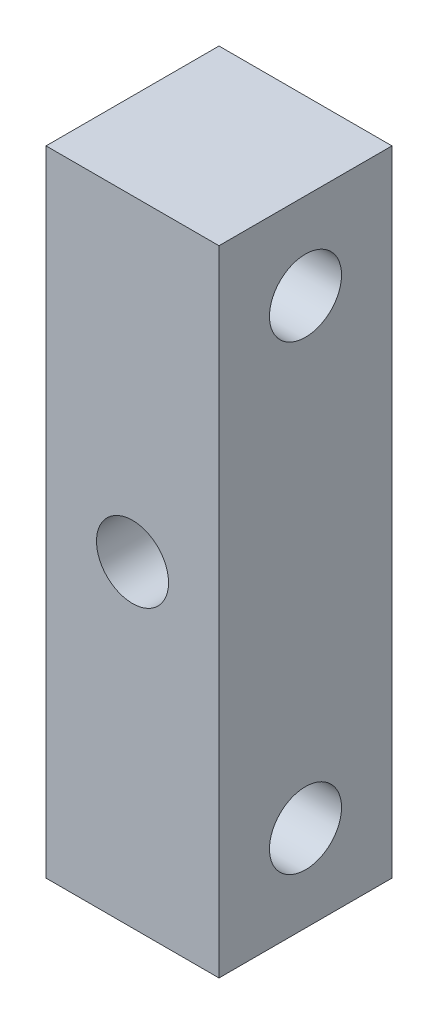
ISO-10303-21;
HEADER;
FILE_DESCRIPTION(('STEP AP214'),'2;1');
FILE_NAME('part.step','',(''),(''),'','','');
FILE_SCHEMA(('AUTOMOTIVE_DESIGN { 1 0 10303 214 1 1 1 1 }'));
ENDSEC;
DATA;
#1=APPLICATION_CONTEXT('core data for automotive mechanical design processes');
#2=APPLICATION_PROTOCOL_DEFINITION('international standard','automotive_design',2000,#1);
#3=PRODUCT_CONTEXT('',#1,'mechanical');
#4=PRODUCT('Part','Part','',(#3));
#5=PRODUCT_RELATED_PRODUCT_CATEGORY('part','',(#4));
#6=PRODUCT_DEFINITION_FORMATION('','',#4);
#7=PRODUCT_DEFINITION_CONTEXT('part definition',#1,'design');
#8=PRODUCT_DEFINITION('design','',#6,#7);
#9=PRODUCT_DEFINITION_SHAPE('','',#8);
#10=(LENGTH_UNIT() NAMED_UNIT(*) SI_UNIT(.MILLI.,.METRE.));
#11=(NAMED_UNIT(*) PLANE_ANGLE_UNIT() SI_UNIT($,.RADIAN.));
#12=(NAMED_UNIT(*) SI_UNIT($,.STERADIAN.) SOLID_ANGLE_UNIT());
#13=UNCERTAINTY_MEASURE_WITH_UNIT(LENGTH_MEASURE(1.E-05),#10,'distance_accuracy_value','');
#14=(GEOMETRIC_REPRESENTATION_CONTEXT(3) GLOBAL_UNCERTAINTY_ASSIGNED_CONTEXT((#13)) GLOBAL_UNIT_ASSIGNED_CONTEXT((#10,
#11,#12)) REPRESENTATION_CONTEXT('',''));
#15=CARTESIAN_POINT('',(0.,0.,0.));
#16=DIRECTION('',(0.,0.,1.));
#17=DIRECTION('',(1.,0.,0.));
#18=AXIS2_PLACEMENT_3D('',#15,#16,#17);
#19=CARTESIAN_POINT('',(6.,0.,0.));
#20=DIRECTION('',(1.,0.,0.));
#21=DIRECTION('',(0.,0.,-1.));
#22=AXIS2_PLACEMENT_3D('',#19,#20,#21);
#23=PLANE('',#22);
#24=CARTESIAN_POINT('',(6.,8.,0.));
#25=DIRECTION('',(1.,0.,0.));
#26=DIRECTION('',(0.,0.,-1.));
#27=AXIS2_PLACEMENT_3D('',#24,#25,#26);
#28=CIRCLE('',#27,1.25);
#29=CARTESIAN_POINT('',(6.,8.,-1.25));
#30=VERTEX_POINT('',#29);
#31=EDGE_CURVE('E103',#30,#30,#28,.T.);
#32=ORIENTED_EDGE('',*,*,#31,.F.);
#33=EDGE_LOOP('',(#32));
#34=FACE_BOUND('',#33,.T.);
#35=DIRECTION('',(0.,1.,0.));
#36=VECTOR('',#35,1.);
#37=CARTESIAN_POINT('',(6.,11.,-3.));
#38=LINE('',#37,#36);
#39=CARTESIAN_POINT('',(6.,-11.,-3.));
#40=VERTEX_POINT('',#39);
#41=CARTESIAN_POINT('',(6.,11.,-3.));
#42=VERTEX_POINT('',#41);
#43=EDGE_CURVE('E88',#40,#42,#38,.T.);
#44=ORIENTED_EDGE('',*,*,#43,.T.);
#45=DIRECTION('',(0.,0.,1.));
#46=VECTOR('',#45,1.);
#47=CARTESIAN_POINT('',(6.,11.,3.));
#48=LINE('',#47,#46);
#49=CARTESIAN_POINT('',(6.,11.,3.));
#50=VERTEX_POINT('',#49);
#51=EDGE_CURVE('E83',#42,#50,#48,.T.);
#52=ORIENTED_EDGE('',*,*,#51,.T.);
#53=DIRECTION('',(0.,-1.,0.));
#54=VECTOR('',#53,1.);
#55=CARTESIAN_POINT('',(6.,11.,3.));
#56=LINE('',#55,#54);
#57=CARTESIAN_POINT('',(6.,-11.,3.));
#58=VERTEX_POINT('',#57);
#59=EDGE_CURVE('E86',#50,#58,#56,.T.);
#60=ORIENTED_EDGE('',*,*,#59,.T.);
#61=DIRECTION('',(0.,0.,-1.));
#62=VECTOR('',#61,1.);
#63=CARTESIAN_POINT('',(6.,-11.,3.));
#64=LINE('',#63,#62);
#65=EDGE_CURVE('E53',#58,#40,#64,.T.);
#66=ORIENTED_EDGE('',*,*,#65,.T.);
#67=EDGE_LOOP('',(#44,#52,#60,#66));
#68=FACE_BOUND('',#67,.T.);
#69=CARTESIAN_POINT('',(6.,-8.,0.));
#70=DIRECTION('',(1.,0.,0.));
#71=DIRECTION('',(0.,0.,-1.));
#72=AXIS2_PLACEMENT_3D('',#69,#70,#71);
#73=CIRCLE('',#72,1.25);
#74=CARTESIAN_POINT('',(6.,-8.,-1.25));
#75=VERTEX_POINT('',#74);
#76=EDGE_CURVE('E118',#75,#75,#73,.T.);
#77=ORIENTED_EDGE('',*,*,#76,.F.);
#78=EDGE_LOOP('',(#77));
#79=FACE_BOUND('',#78,.T.);
#80=ADVANCED_FACE('F36',(#34,#68,#79),#23,.T.);
#81=CARTESIAN_POINT('',(0.,0.,0.));
#82=DIRECTION('',(1.,0.,0.));
#83=DIRECTION('',(0.,0.,-1.));
#84=AXIS2_PLACEMENT_3D('',#81,#82,#83);
#85=PLANE('',#84);
#86=DIRECTION('',(0.,1.,0.));
#87=VECTOR('',#86,1.);
#88=CARTESIAN_POINT('',(0.,11.,-3.));
#89=LINE('',#88,#87);
#90=CARTESIAN_POINT('',(0.,-11.,-3.));
#91=VERTEX_POINT('',#90);
#92=CARTESIAN_POINT('',(0.,11.,-3.));
#93=VERTEX_POINT('',#92);
#94=EDGE_CURVE('E100',#91,#93,#89,.T.);
#95=ORIENTED_EDGE('',*,*,#94,.F.);
#96=DIRECTION('',(0.,0.,-1.));
#97=VECTOR('',#96,1.);
#98=CARTESIAN_POINT('',(0.,-11.,3.));
#99=LINE('',#98,#97);
#100=CARTESIAN_POINT('',(0.,-11.,3.));
#101=VERTEX_POINT('',#100);
#102=EDGE_CURVE('E76',#101,#91,#99,.T.);
#103=ORIENTED_EDGE('',*,*,#102,.F.);
#104=DIRECTION('',(0.,-1.,0.));
#105=VECTOR('',#104,1.);
#106=CARTESIAN_POINT('',(0.,11.,3.));
#107=LINE('',#106,#105);
#108=CARTESIAN_POINT('',(0.,11.,3.));
#109=VERTEX_POINT('',#108);
#110=EDGE_CURVE('E70',#109,#101,#107,.T.);
#111=ORIENTED_EDGE('',*,*,#110,.F.);
#112=DIRECTION('',(0.,0.,1.));
#113=VECTOR('',#112,1.);
#114=CARTESIAN_POINT('',(0.,11.,3.));
#115=LINE('',#114,#113);
#116=EDGE_CURVE('E92',#93,#109,#115,.T.);
#117=ORIENTED_EDGE('',*,*,#116,.F.);
#118=EDGE_LOOP('',(#95,#103,#111,#117));
#119=FACE_BOUND('',#118,.T.);
#120=CARTESIAN_POINT('',(0.,8.,0.));
#121=DIRECTION('',(1.,0.,0.));
#122=DIRECTION('',(0.,0.,-1.));
#123=AXIS2_PLACEMENT_3D('',#120,#121,#122);
#124=CIRCLE('',#123,1.25);
#125=CARTESIAN_POINT('',(0.,8.,-1.25));
#126=VERTEX_POINT('',#125);
#127=EDGE_CURVE('E115',#126,#126,#124,.T.);
#128=ORIENTED_EDGE('',*,*,#127,.T.);
#129=EDGE_LOOP('',(#128));
#130=FACE_BOUND('',#129,.T.);
#131=CARTESIAN_POINT('',(0.,-8.,0.));
#132=DIRECTION('',(1.,0.,0.));
#133=DIRECTION('',(0.,0.,-1.));
#134=AXIS2_PLACEMENT_3D('',#131,#132,#133);
#135=CIRCLE('',#134,1.25);
#136=CARTESIAN_POINT('',(0.,-8.,-1.25));
#137=VERTEX_POINT('',#136);
#138=EDGE_CURVE('E121',#137,#137,#135,.T.);
#139=ORIENTED_EDGE('',*,*,#138,.T.);
#140=EDGE_LOOP('',(#139));
#141=FACE_BOUND('',#140,.T.);
#142=ADVANCED_FACE('F111',(#119,#130,#141),#85,.F.);
#143=CARTESIAN_POINT('',(6.,11.,-3.));
#144=DIRECTION('',(0.,0.,1.));
#145=DIRECTION('',(1.,0.,0.));
#146=AXIS2_PLACEMENT_3D('',#143,#144,#145);
#147=PLANE('',#146);
#148=CARTESIAN_POINT('',(3.,0.,-3.));
#149=DIRECTION('',(0.,0.,1.));
#150=DIRECTION('',(1.,0.,0.));
#151=AXIS2_PLACEMENT_3D('',#148,#149,#150);
#152=CIRCLE('',#151,1.25);
#153=CARTESIAN_POINT('',(4.25,0.,-3.));
#154=VERTEX_POINT('',#153);
#155=EDGE_CURVE('E124',#154,#154,#152,.T.);
#156=ORIENTED_EDGE('',*,*,#155,.T.);
#157=EDGE_LOOP('',(#156));
#158=FACE_BOUND('',#157,.T.);
#159=ORIENTED_EDGE('',*,*,#94,.T.);
#160=DIRECTION('',(-1.,0.,0.));
#161=VECTOR('',#160,1.);
#162=CARTESIAN_POINT('',(6.,11.,-3.));
#163=LINE('',#162,#161);
#164=EDGE_CURVE('E11',#42,#93,#163,.T.);
#165=ORIENTED_EDGE('',*,*,#164,.F.);
#166=ORIENTED_EDGE('',*,*,#43,.F.);
#167=DIRECTION('',(-1.,0.,0.));
#168=VECTOR('',#167,1.);
#169=CARTESIAN_POINT('',(6.,-11.,-3.));
#170=LINE('',#169,#168);
#171=EDGE_CURVE('E96',#40,#91,#170,.T.);
#172=ORIENTED_EDGE('',*,*,#171,.T.);
#173=EDGE_LOOP('',(#159,#165,#166,#172));
#174=FACE_BOUND('',#173,.T.);
#175=ADVANCED_FACE('F38',(#158,#174),#147,.F.);
#176=CARTESIAN_POINT('',(6.,11.,3.));
#177=DIRECTION('',(0.,-1.,0.));
#178=DIRECTION('',(0.,0.,-1.));
#179=AXIS2_PLACEMENT_3D('',#176,#177,#178);
#180=PLANE('',#179);
#181=ORIENTED_EDGE('',*,*,#116,.T.);
#182=DIRECTION('',(-1.,0.,0.));
#183=VECTOR('',#182,1.);
#184=CARTESIAN_POINT('',(6.,11.,3.));
#185=LINE('',#184,#183);
#186=EDGE_CURVE('E45',#50,#109,#185,.T.);
#187=ORIENTED_EDGE('',*,*,#186,.F.);
#188=ORIENTED_EDGE('',*,*,#51,.F.);
#189=ORIENTED_EDGE('',*,*,#164,.T.);
#190=EDGE_LOOP('',(#181,#187,#188,#189));
#191=FACE_BOUND('',#190,.T.);
#192=ADVANCED_FACE('F91',(#191),#180,.F.);
#193=CARTESIAN_POINT('',(6.,11.,3.));
#194=DIRECTION('',(0.,0.,-1.));
#195=DIRECTION('',(-1.,0.,0.));
#196=AXIS2_PLACEMENT_3D('',#193,#194,#195);
#197=PLANE('',#196);
#198=CARTESIAN_POINT('',(3.,0.,3.));
#199=DIRECTION('',(0.,0.,1.));
#200=DIRECTION('',(1.,0.,0.));
#201=AXIS2_PLACEMENT_3D('',#198,#199,#200);
#202=CIRCLE('',#201,1.25);
#203=CARTESIAN_POINT('',(4.25,0.,3.));
#204=VERTEX_POINT('',#203);
#205=EDGE_CURVE('E127',#204,#204,#202,.T.);
#206=ORIENTED_EDGE('',*,*,#205,.F.);
#207=EDGE_LOOP('',(#206));
#208=FACE_BOUND('',#207,.T.);
#209=ORIENTED_EDGE('',*,*,#110,.T.);
#210=DIRECTION('',(-1.,0.,0.));
#211=VECTOR('',#210,1.);
#212=CARTESIAN_POINT('',(6.,-11.,3.));
#213=LINE('',#212,#211);
#214=EDGE_CURVE('E93',#58,#101,#213,.T.);
#215=ORIENTED_EDGE('',*,*,#214,.F.);
#216=ORIENTED_EDGE('',*,*,#59,.F.);
#217=ORIENTED_EDGE('',*,*,#186,.T.);
#218=EDGE_LOOP('',(#209,#215,#216,#217));
#219=FACE_BOUND('',#218,.T.);
#220=ADVANCED_FACE('F94',(#208,#219),#197,.F.);
#221=CARTESIAN_POINT('',(6.,-11.,3.));
#222=DIRECTION('',(0.,1.,0.));
#223=DIRECTION('',(0.,0.,1.));
#224=AXIS2_PLACEMENT_3D('',#221,#222,#223);
#225=PLANE('',#224);
#226=ORIENTED_EDGE('',*,*,#102,.T.);
#227=ORIENTED_EDGE('',*,*,#171,.F.);
#228=ORIENTED_EDGE('',*,*,#65,.F.);
#229=ORIENTED_EDGE('',*,*,#214,.T.);
#230=EDGE_LOOP('',(#226,#227,#228,#229));
#231=FACE_BOUND('',#230,.T.);
#232=ADVANCED_FACE('F108',(#231),#225,.F.);
#233=CARTESIAN_POINT('',(6.,8.,0.));
#234=DIRECTION('',(-1.,0.,0.));
#235=DIRECTION('',(0.,0.,1.));
#236=AXIS2_PLACEMENT_3D('',#233,#234,#235);
#237=CYLINDRICAL_SURFACE('',#236,1.25);
#238=ORIENTED_EDGE('',*,*,#31,.T.);
#239=EDGE_LOOP('',(#238));
#240=FACE_BOUND('',#239,.T.);
#241=ORIENTED_EDGE('',*,*,#127,.F.);
#242=EDGE_LOOP('',(#241));
#243=FACE_BOUND('',#242,.T.);
#244=ADVANCED_FACE('F147',(#240,#243),#237,.F.);
#245=CARTESIAN_POINT('',(6.,-8.,0.));
#246=DIRECTION('',(-1.,0.,0.));
#247=DIRECTION('',(0.,0.,1.));
#248=AXIS2_PLACEMENT_3D('',#245,#246,#247);
#249=CYLINDRICAL_SURFACE('',#248,1.25);
#250=ORIENTED_EDGE('',*,*,#76,.T.);
#251=EDGE_LOOP('',(#250));
#252=FACE_BOUND('',#251,.T.);
#253=ORIENTED_EDGE('',*,*,#138,.F.);
#254=EDGE_LOOP('',(#253));
#255=FACE_BOUND('',#254,.T.);
#256=ADVANCED_FACE('F137',(#252,#255),#249,.F.);
#257=CARTESIAN_POINT('',(3.,0.,-3.));
#258=DIRECTION('',(0.,0.,1.));
#259=DIRECTION('',(1.,0.,0.));
#260=AXIS2_PLACEMENT_3D('',#257,#258,#259);
#261=CYLINDRICAL_SURFACE('',#260,1.25);
#262=ORIENTED_EDGE('',*,*,#155,.F.);
#263=EDGE_LOOP('',(#262));
#264=FACE_BOUND('',#263,.T.);
#265=ORIENTED_EDGE('',*,*,#205,.T.);
#266=EDGE_LOOP('',(#265));
#267=FACE_BOUND('',#266,.T.);
#268=ADVANCED_FACE('F134',(#264,#267),#261,.F.);
#269=CLOSED_SHELL('',(#80,#142,#175,#192,#220,#232,#244,#256,#268));
#270=MANIFOLD_SOLID_BREP('B2',#269);
#271=ADVANCED_BREP_SHAPE_REPRESENTATION('',(#18,#270),#14);
#272=SHAPE_DEFINITION_REPRESENTATION(#9,#271);
ENDSEC;
END-ISO-10303-21;
